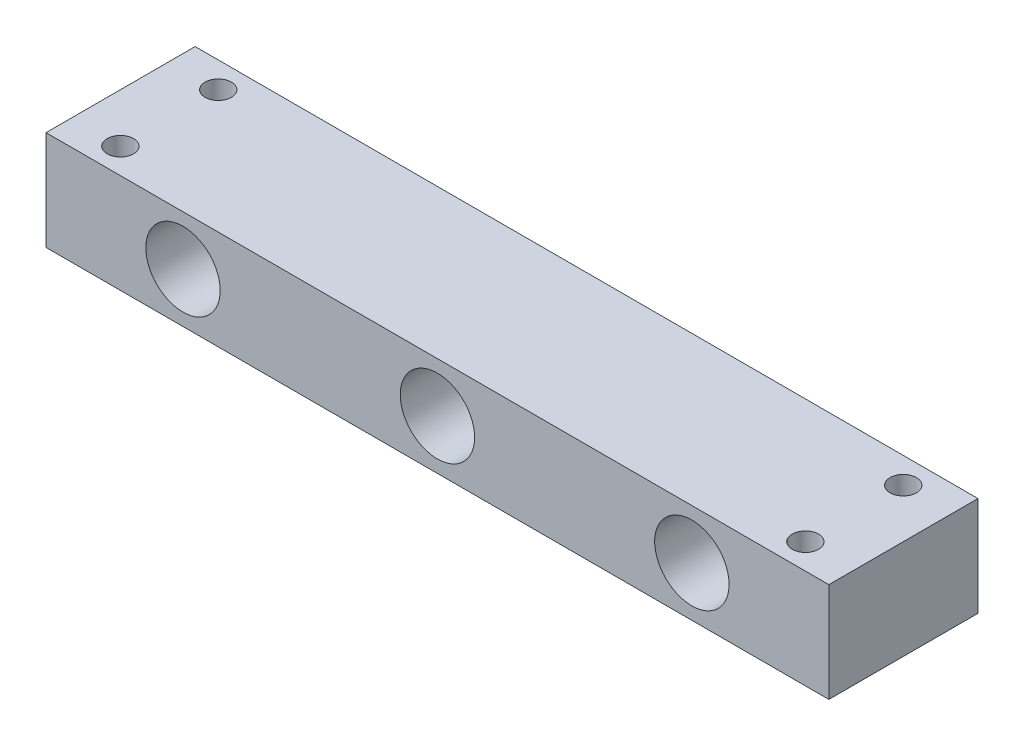
ISO-10303-21;
HEADER;
FILE_DESCRIPTION(('STEP AP214'),'2;1');
FILE_NAME('part.step','',(''),(''),'','','');
FILE_SCHEMA(('AUTOMOTIVE_DESIGN { 1 0 10303 214 1 1 1 1 }'));
ENDSEC;
DATA;
#1=APPLICATION_CONTEXT('core data for automotive mechanical design processes');
#2=APPLICATION_PROTOCOL_DEFINITION('international standard','automotive_design',2000,#1);
#3=PRODUCT_CONTEXT('',#1,'mechanical');
#4=PRODUCT('Part','Part','',(#3));
#5=PRODUCT_RELATED_PRODUCT_CATEGORY('part','',(#4));
#6=PRODUCT_DEFINITION_FORMATION('','',#4);
#7=PRODUCT_DEFINITION_CONTEXT('part definition',#1,'design');
#8=PRODUCT_DEFINITION('design','',#6,#7);
#9=PRODUCT_DEFINITION_SHAPE('','',#8);
#10=(LENGTH_UNIT() NAMED_UNIT(*) SI_UNIT(.MILLI.,.METRE.));
#11=(NAMED_UNIT(*) PLANE_ANGLE_UNIT() SI_UNIT($,.RADIAN.));
#12=(NAMED_UNIT(*) SI_UNIT($,.STERADIAN.) SOLID_ANGLE_UNIT());
#13=UNCERTAINTY_MEASURE_WITH_UNIT(LENGTH_MEASURE(1.E-05),#10,'distance_accuracy_value','');
#14=(GEOMETRIC_REPRESENTATION_CONTEXT(3) GLOBAL_UNCERTAINTY_ASSIGNED_CONTEXT((#13)) GLOBAL_UNIT_ASSIGNED_CONTEXT((#10,
#11,#12)) REPRESENTATION_CONTEXT('',''));
#15=CARTESIAN_POINT('',(0.,0.,0.));
#16=DIRECTION('',(0.,0.,1.));
#17=DIRECTION('',(1.,0.,0.));
#18=AXIS2_PLACEMENT_3D('',#15,#16,#17);
#19=CARTESIAN_POINT('',(0.,50.8,0.));
#20=DIRECTION('',(1.,0.,0.));
#21=DIRECTION('',(0.,0.,-1.));
#22=AXIS2_PLACEMENT_3D('',#19,#20,#21);
#23=PLANE('',#22);
#24=DIRECTION('',(0.,0.,1.));
#25=VECTOR('',#24,1.);
#26=CARTESIAN_POINT('',(0.,0.,0.));
#27=LINE('',#26,#25);
#28=CARTESIAN_POINT('',(0.,0.,-76.2));
#29=VERTEX_POINT('',#28);
#30=CARTESIAN_POINT('',(0.,0.,0.));
#31=VERTEX_POINT('',#30);
#32=EDGE_CURVE('E94',#29,#31,#27,.T.);
#33=ORIENTED_EDGE('',*,*,#32,.T.);
#34=DIRECTION('',(0.,-1.,0.));
#35=VECTOR('',#34,1.);
#36=CARTESIAN_POINT('',(0.,50.8,0.));
#37=LINE('',#36,#35);
#38=CARTESIAN_POINT('',(0.,50.8,0.));
#39=VERTEX_POINT('',#38);
#40=EDGE_CURVE('E11',#39,#31,#37,.T.);
#41=ORIENTED_EDGE('',*,*,#40,.F.);
#42=DIRECTION('',(0.,0.,1.));
#43=VECTOR('',#42,1.);
#44=CARTESIAN_POINT('',(0.,50.8,0.));
#45=LINE('',#44,#43);
#46=CARTESIAN_POINT('',(0.,50.8,-76.2));
#47=VERTEX_POINT('',#46);
#48=EDGE_CURVE('E82',#47,#39,#45,.T.);
#49=ORIENTED_EDGE('',*,*,#48,.F.);
#50=DIRECTION('',(0.,-1.,0.));
#51=VECTOR('',#50,1.);
#52=CARTESIAN_POINT('',(0.,50.8,-76.2));
#53=LINE('',#52,#51);
#54=EDGE_CURVE('E90',#47,#29,#53,.T.);
#55=ORIENTED_EDGE('',*,*,#54,.T.);
#56=EDGE_LOOP('',(#33,#41,#49,#55));
#57=FACE_BOUND('',#56,.T.);
#58=ADVANCED_FACE('F31',(#57),#23,.F.);
#59=CARTESIAN_POINT('',(0.,50.8,0.));
#60=DIRECTION('',(0.,0.,-1.));
#61=DIRECTION('',(-1.,0.,0.));
#62=AXIS2_PLACEMENT_3D('',#59,#60,#61);
#63=PLANE('',#62);
#64=CARTESIAN_POINT('',(330.,25.4,0.));
#65=DIRECTION('',(0.,0.,1.));
#66=DIRECTION('',(1.,0.,0.));
#67=AXIS2_PLACEMENT_3D('',#64,#65,#66);
#68=CIRCLE('',#67,19.);
#69=CARTESIAN_POINT('',(349.,25.4,0.));
#70=VERTEX_POINT('',#69);
#71=EDGE_CURVE('E144',#70,#70,#68,.T.);
#72=ORIENTED_EDGE('',*,*,#71,.F.);
#73=EDGE_LOOP('',(#72));
#74=FACE_BOUND('',#73,.T.);
#75=CARTESIAN_POINT('',(200.,25.4,0.));
#76=DIRECTION('',(0.,0.,1.));
#77=DIRECTION('',(1.,0.,0.));
#78=AXIS2_PLACEMENT_3D('',#75,#76,#77);
#79=CIRCLE('',#78,19.);
#80=CARTESIAN_POINT('',(219.,25.4,0.));
#81=VERTEX_POINT('',#80);
#82=EDGE_CURVE('E138',#81,#81,#79,.T.);
#83=ORIENTED_EDGE('',*,*,#82,.F.);
#84=EDGE_LOOP('',(#83));
#85=FACE_BOUND('',#84,.T.);
#86=CARTESIAN_POINT('',(70.,25.4,0.));
#87=DIRECTION('',(0.,0.,1.));
#88=DIRECTION('',(1.,0.,0.));
#89=AXIS2_PLACEMENT_3D('',#86,#87,#88);
#90=CIRCLE('',#89,19.);
#91=CARTESIAN_POINT('',(89.,25.4,0.));
#92=VERTEX_POINT('',#91);
#93=EDGE_CURVE('E132',#92,#92,#90,.T.);
#94=ORIENTED_EDGE('',*,*,#93,.F.);
#95=EDGE_LOOP('',(#94));
#96=FACE_BOUND('',#95,.T.);
#97=DIRECTION('',(1.,0.,0.));
#98=VECTOR('',#97,1.);
#99=CARTESIAN_POINT('',(0.,0.,0.));
#100=LINE('',#99,#98);
#101=CARTESIAN_POINT('',(400.,0.,0.));
#102=VERTEX_POINT('',#101);
#103=EDGE_CURVE('E86',#31,#102,#100,.T.);
#104=ORIENTED_EDGE('',*,*,#103,.T.);
#105=DIRECTION('',(0.,-1.,0.));
#106=VECTOR('',#105,1.);
#107=CARTESIAN_POINT('',(400.,50.8,0.));
#108=LINE('',#107,#106);
#109=CARTESIAN_POINT('',(400.,50.8,0.));
#110=VERTEX_POINT('',#109);
#111=EDGE_CURVE('E39',#110,#102,#108,.T.);
#112=ORIENTED_EDGE('',*,*,#111,.F.);
#113=DIRECTION('',(1.,0.,0.));
#114=VECTOR('',#113,1.);
#115=CARTESIAN_POINT('',(0.,50.8,0.));
#116=LINE('',#115,#114);
#117=EDGE_CURVE('E77',#39,#110,#116,.T.);
#118=ORIENTED_EDGE('',*,*,#117,.F.);
#119=ORIENTED_EDGE('',*,*,#40,.T.);
#120=EDGE_LOOP('',(#104,#112,#118,#119));
#121=FACE_BOUND('',#120,.T.);
#122=ADVANCED_FACE('F85',(#74,#85,#96,#121),#63,.F.);
#123=CARTESIAN_POINT('',(400.,50.8,0.));
#124=DIRECTION('',(-1.,0.,0.));
#125=DIRECTION('',(0.,0.,1.));
#126=AXIS2_PLACEMENT_3D('',#123,#124,#125);
#127=PLANE('',#126);
#128=DIRECTION('',(0.,0.,-1.));
#129=VECTOR('',#128,1.);
#130=CARTESIAN_POINT('',(400.,0.,0.));
#131=LINE('',#130,#129);
#132=CARTESIAN_POINT('',(400.,0.,-76.2));
#133=VERTEX_POINT('',#132);
#134=EDGE_CURVE('E64',#102,#133,#131,.T.);
#135=ORIENTED_EDGE('',*,*,#134,.T.);
#136=DIRECTION('',(0.,-1.,0.));
#137=VECTOR('',#136,1.);
#138=CARTESIAN_POINT('',(400.,50.8,-76.2));
#139=LINE('',#138,#137);
#140=CARTESIAN_POINT('',(400.,50.8,-76.2));
#141=VERTEX_POINT('',#140);
#142=EDGE_CURVE('E87',#141,#133,#139,.T.);
#143=ORIENTED_EDGE('',*,*,#142,.F.);
#144=DIRECTION('',(0.,0.,-1.));
#145=VECTOR('',#144,1.);
#146=CARTESIAN_POINT('',(400.,50.8,0.));
#147=LINE('',#146,#145);
#148=EDGE_CURVE('E80',#110,#141,#147,.T.);
#149=ORIENTED_EDGE('',*,*,#148,.F.);
#150=ORIENTED_EDGE('',*,*,#111,.T.);
#151=EDGE_LOOP('',(#135,#143,#149,#150));
#152=FACE_BOUND('',#151,.T.);
#153=ADVANCED_FACE('F88',(#152),#127,.F.);
#154=CARTESIAN_POINT('',(0.,50.8,-76.2));
#155=DIRECTION('',(0.,0.,1.));
#156=DIRECTION('',(1.,0.,0.));
#157=AXIS2_PLACEMENT_3D('',#154,#155,#156);
#158=PLANE('',#157);
#159=CARTESIAN_POINT('',(330.,25.4,-76.2));
#160=DIRECTION('',(0.,0.,1.));
#161=DIRECTION('',(1.,0.,0.));
#162=AXIS2_PLACEMENT_3D('',#159,#160,#161);
#163=CIRCLE('',#162,19.);
#164=CARTESIAN_POINT('',(349.,25.4,-76.2));
#165=VERTEX_POINT('',#164);
#166=EDGE_CURVE('E141',#165,#165,#163,.T.);
#167=ORIENTED_EDGE('',*,*,#166,.T.);
#168=EDGE_LOOP('',(#167));
#169=FACE_BOUND('',#168,.T.);
#170=CARTESIAN_POINT('',(200.,25.4,-76.2));
#171=DIRECTION('',(0.,0.,1.));
#172=DIRECTION('',(1.,0.,0.));
#173=AXIS2_PLACEMENT_3D('',#170,#171,#172);
#174=CIRCLE('',#173,19.);
#175=CARTESIAN_POINT('',(219.,25.4,-76.2));
#176=VERTEX_POINT('',#175);
#177=EDGE_CURVE('E135',#176,#176,#174,.T.);
#178=ORIENTED_EDGE('',*,*,#177,.T.);
#179=EDGE_LOOP('',(#178));
#180=FACE_BOUND('',#179,.T.);
#181=CARTESIAN_POINT('',(70.,25.4,-76.2));
#182=DIRECTION('',(0.,0.,1.));
#183=DIRECTION('',(1.,0.,0.));
#184=AXIS2_PLACEMENT_3D('',#181,#182,#183);
#185=CIRCLE('',#184,19.);
#186=CARTESIAN_POINT('',(89.,25.4,-76.2));
#187=VERTEX_POINT('',#186);
#188=EDGE_CURVE('E129',#187,#187,#185,.T.);
#189=ORIENTED_EDGE('',*,*,#188,.T.);
#190=EDGE_LOOP('',(#189));
#191=FACE_BOUND('',#190,.T.);
#192=DIRECTION('',(-1.,0.,0.));
#193=VECTOR('',#192,1.);
#194=CARTESIAN_POINT('',(0.,0.,-76.2));
#195=LINE('',#194,#193);
#196=EDGE_CURVE('E70',#133,#29,#195,.T.);
#197=ORIENTED_EDGE('',*,*,#196,.T.);
#198=ORIENTED_EDGE('',*,*,#54,.F.);
#199=DIRECTION('',(-1.,0.,0.));
#200=VECTOR('',#199,1.);
#201=CARTESIAN_POINT('',(0.,50.8,-76.2));
#202=LINE('',#201,#200);
#203=EDGE_CURVE('E47',#141,#47,#202,.T.);
#204=ORIENTED_EDGE('',*,*,#203,.F.);
#205=ORIENTED_EDGE('',*,*,#142,.T.);
#206=EDGE_LOOP('',(#197,#198,#204,#205));
#207=FACE_BOUND('',#206,.T.);
#208=ADVANCED_FACE('F102',(#169,#180,#191,#207),#158,.F.);
#209=CARTESIAN_POINT('',(0.,50.8,-76.2));
#210=DIRECTION('',(0.,-1.,0.));
#211=DIRECTION('',(0.,0.,-1.));
#212=AXIS2_PLACEMENT_3D('',#209,#210,#211);
#213=PLANE('',#212);
#214=CARTESIAN_POINT('',(25.,50.8,-63.));
#215=DIRECTION('',(0.,1.,0.));
#216=DIRECTION('',(0.,0.,1.));
#217=AXIS2_PLACEMENT_3D('',#214,#215,#216);
#218=CIRCLE('',#217,6.75);
#219=CARTESIAN_POINT('',(25.,50.8,-56.25));
#220=VERTEX_POINT('',#219);
#221=EDGE_CURVE('E123',#220,#220,#218,.T.);
#222=ORIENTED_EDGE('',*,*,#221,.F.);
#223=EDGE_LOOP('',(#222));
#224=FACE_BOUND('',#223,.T.);
#225=CARTESIAN_POINT('',(375.,50.8,-13.));
#226=DIRECTION('',(0.,1.,0.));
#227=DIRECTION('',(0.,0.,1.));
#228=AXIS2_PLACEMENT_3D('',#225,#226,#227);
#229=CIRCLE('',#228,6.74999999999997);
#230=CARTESIAN_POINT('',(375.,50.8,-6.25000000000002));
#231=VERTEX_POINT('',#230);
#232=EDGE_CURVE('E117',#231,#231,#229,.T.);
#233=ORIENTED_EDGE('',*,*,#232,.F.);
#234=EDGE_LOOP('',(#233));
#235=FACE_BOUND('',#234,.T.);
#236=CARTESIAN_POINT('',(25.,50.8,-13.));
#237=DIRECTION('',(0.,1.,0.));
#238=DIRECTION('',(0.,0.,1.));
#239=AXIS2_PLACEMENT_3D('',#236,#237,#238);
#240=CIRCLE('',#239,6.75);
#241=CARTESIAN_POINT('',(25.,50.8,-6.24999999999999));
#242=VERTEX_POINT('',#241);
#243=EDGE_CURVE('E111',#242,#242,#240,.T.);
#244=ORIENTED_EDGE('',*,*,#243,.F.);
#245=EDGE_LOOP('',(#244));
#246=FACE_BOUND('',#245,.T.);
#247=CARTESIAN_POINT('',(375.,50.8,-63.));
#248=DIRECTION('',(0.,1.,0.));
#249=DIRECTION('',(0.,0.,1.));
#250=AXIS2_PLACEMENT_3D('',#247,#248,#249);
#251=CIRCLE('',#250,6.74999999999997);
#252=CARTESIAN_POINT('',(375.,50.8,-56.25));
#253=VERTEX_POINT('',#252);
#254=EDGE_CURVE('E108',#253,#253,#251,.T.);
#255=ORIENTED_EDGE('',*,*,#254,.F.);
#256=EDGE_LOOP('',(#255));
#257=FACE_BOUND('',#256,.T.);
#258=ORIENTED_EDGE('',*,*,#48,.T.);
#259=ORIENTED_EDGE('',*,*,#117,.T.);
#260=ORIENTED_EDGE('',*,*,#148,.T.);
#261=ORIENTED_EDGE('',*,*,#203,.T.);
#262=EDGE_LOOP('',(#258,#259,#260,#261));
#263=FACE_BOUND('',#262,.T.);
#264=ADVANCED_FACE('F78',(#224,#235,#246,#257,#263),#213,.F.);
#265=CARTESIAN_POINT('',(0.,0.,-76.2));
#266=DIRECTION('',(0.,-1.,0.));
#267=DIRECTION('',(0.,0.,-1.));
#268=AXIS2_PLACEMENT_3D('',#265,#266,#267);
#269=PLANE('',#268);
#270=CARTESIAN_POINT('',(25.,0.,-63.));
#271=DIRECTION('',(0.,1.,0.));
#272=DIRECTION('',(0.,0.,1.));
#273=AXIS2_PLACEMENT_3D('',#270,#271,#272);
#274=CIRCLE('',#273,6.75);
#275=CARTESIAN_POINT('',(25.,0.,-56.25));
#276=VERTEX_POINT('',#275);
#277=EDGE_CURVE('E126',#276,#276,#274,.T.);
#278=ORIENTED_EDGE('',*,*,#277,.T.);
#279=EDGE_LOOP('',(#278));
#280=FACE_BOUND('',#279,.T.);
#281=CARTESIAN_POINT('',(375.,0.,-13.));
#282=DIRECTION('',(0.,1.,0.));
#283=DIRECTION('',(0.,0.,1.));
#284=AXIS2_PLACEMENT_3D('',#281,#282,#283);
#285=CIRCLE('',#284,6.74999999999997);
#286=CARTESIAN_POINT('',(375.,0.,-6.25000000000002));
#287=VERTEX_POINT('',#286);
#288=EDGE_CURVE('E120',#287,#287,#285,.T.);
#289=ORIENTED_EDGE('',*,*,#288,.T.);
#290=EDGE_LOOP('',(#289));
#291=FACE_BOUND('',#290,.T.);
#292=CARTESIAN_POINT('',(25.,0.,-13.));
#293=DIRECTION('',(0.,1.,0.));
#294=DIRECTION('',(0.,0.,1.));
#295=AXIS2_PLACEMENT_3D('',#292,#293,#294);
#296=CIRCLE('',#295,6.75);
#297=CARTESIAN_POINT('',(25.,0.,-6.24999999999999));
#298=VERTEX_POINT('',#297);
#299=EDGE_CURVE('E114',#298,#298,#296,.T.);
#300=ORIENTED_EDGE('',*,*,#299,.T.);
#301=EDGE_LOOP('',(#300));
#302=FACE_BOUND('',#301,.T.);
#303=CARTESIAN_POINT('',(375.,0.,-63.));
#304=DIRECTION('',(0.,1.,0.));
#305=DIRECTION('',(0.,0.,1.));
#306=AXIS2_PLACEMENT_3D('',#303,#304,#305);
#307=CIRCLE('',#306,6.74999999999997);
#308=CARTESIAN_POINT('',(375.,0.,-56.25));
#309=VERTEX_POINT('',#308);
#310=EDGE_CURVE('E97',#309,#309,#307,.T.);
#311=ORIENTED_EDGE('',*,*,#310,.T.);
#312=EDGE_LOOP('',(#311));
#313=FACE_BOUND('',#312,.T.);
#314=ORIENTED_EDGE('',*,*,#32,.F.);
#315=ORIENTED_EDGE('',*,*,#196,.F.);
#316=ORIENTED_EDGE('',*,*,#134,.F.);
#317=ORIENTED_EDGE('',*,*,#103,.F.);
#318=EDGE_LOOP('',(#314,#315,#316,#317));
#319=FACE_BOUND('',#318,.T.);
#320=ADVANCED_FACE('F105',(#280,#291,#302,#313,#319),#269,.T.);
#321=CARTESIAN_POINT('',(375.,0.,-63.));
#322=DIRECTION('',(0.,1.,0.));
#323=DIRECTION('',(0.,0.,1.));
#324=AXIS2_PLACEMENT_3D('',#321,#322,#323);
#325=CYLINDRICAL_SURFACE('',#324,6.74999999999997);
#326=ORIENTED_EDGE('',*,*,#310,.F.);
#327=EDGE_LOOP('',(#326));
#328=FACE_BOUND('',#327,.T.);
#329=ORIENTED_EDGE('',*,*,#254,.T.);
#330=EDGE_LOOP('',(#329));
#331=FACE_BOUND('',#330,.T.);
#332=ADVANCED_FACE('F213',(#328,#331),#325,.F.);
#333=CARTESIAN_POINT('',(25.,0.,-13.));
#334=DIRECTION('',(0.,1.,0.));
#335=DIRECTION('',(0.,0.,1.));
#336=AXIS2_PLACEMENT_3D('',#333,#334,#335);
#337=CYLINDRICAL_SURFACE('',#336,6.75);
#338=ORIENTED_EDGE('',*,*,#299,.F.);
#339=EDGE_LOOP('',(#338));
#340=FACE_BOUND('',#339,.T.);
#341=ORIENTED_EDGE('',*,*,#243,.T.);
#342=EDGE_LOOP('',(#341));
#343=FACE_BOUND('',#342,.T.);
#344=ADVANCED_FACE('F221',(#340,#343),#337,.F.);
#345=CARTESIAN_POINT('',(375.,0.,-13.));
#346=DIRECTION('',(0.,1.,0.));
#347=DIRECTION('',(0.,0.,1.));
#348=AXIS2_PLACEMENT_3D('',#345,#346,#347);
#349=CYLINDRICAL_SURFACE('',#348,6.74999999999997);
#350=ORIENTED_EDGE('',*,*,#288,.F.);
#351=EDGE_LOOP('',(#350));
#352=FACE_BOUND('',#351,.T.);
#353=ORIENTED_EDGE('',*,*,#232,.T.);
#354=EDGE_LOOP('',(#353));
#355=FACE_BOUND('',#354,.T.);
#356=ADVANCED_FACE('F176',(#352,#355),#349,.F.);
#357=CARTESIAN_POINT('',(25.,0.,-63.));
#358=DIRECTION('',(0.,1.,0.));
#359=DIRECTION('',(0.,0.,1.));
#360=AXIS2_PLACEMENT_3D('',#357,#358,#359);
#361=CYLINDRICAL_SURFACE('',#360,6.75);
#362=ORIENTED_EDGE('',*,*,#277,.F.);
#363=EDGE_LOOP('',(#362));
#364=FACE_BOUND('',#363,.T.);
#365=ORIENTED_EDGE('',*,*,#221,.T.);
#366=EDGE_LOOP('',(#365));
#367=FACE_BOUND('',#366,.T.);
#368=ADVANCED_FACE('F167',(#364,#367),#361,.F.);
#369=CARTESIAN_POINT('',(70.,25.4,-76.2));
#370=DIRECTION('',(0.,0.,1.));
#371=DIRECTION('',(1.,0.,0.));
#372=AXIS2_PLACEMENT_3D('',#369,#370,#371);
#373=CYLINDRICAL_SURFACE('',#372,19.);
#374=ORIENTED_EDGE('',*,*,#188,.F.);
#375=EDGE_LOOP('',(#374));
#376=FACE_BOUND('',#375,.T.);
#377=ORIENTED_EDGE('',*,*,#93,.T.);
#378=EDGE_LOOP('',(#377));
#379=FACE_BOUND('',#378,.T.);
#380=ADVANCED_FACE('F165',(#376,#379),#373,.F.);
#381=CARTESIAN_POINT('',(200.,25.4,-76.2));
#382=DIRECTION('',(0.,0.,1.));
#383=DIRECTION('',(1.,0.,0.));
#384=AXIS2_PLACEMENT_3D('',#381,#382,#383);
#385=CYLINDRICAL_SURFACE('',#384,19.);
#386=ORIENTED_EDGE('',*,*,#177,.F.);
#387=EDGE_LOOP('',(#386));
#388=FACE_BOUND('',#387,.T.);
#389=ORIENTED_EDGE('',*,*,#82,.T.);
#390=EDGE_LOOP('',(#389));
#391=FACE_BOUND('',#390,.T.);
#392=ADVANCED_FACE('F155',(#388,#391),#385,.F.);
#393=CARTESIAN_POINT('',(330.,25.4,-76.2));
#394=DIRECTION('',(0.,0.,1.));
#395=DIRECTION('',(1.,0.,0.));
#396=AXIS2_PLACEMENT_3D('',#393,#394,#395);
#397=CYLINDRICAL_SURFACE('',#396,19.);
#398=ORIENTED_EDGE('',*,*,#166,.F.);
#399=EDGE_LOOP('',(#398));
#400=FACE_BOUND('',#399,.T.);
#401=ORIENTED_EDGE('',*,*,#71,.T.);
#402=EDGE_LOOP('',(#401));
#403=FACE_BOUND('',#402,.T.);
#404=ADVANCED_FACE('F152',(#400,#403),#397,.F.);
#405=CLOSED_SHELL('',(#58,#122,#153,#208,#264,#320,#332,#344,#356,#368,#380,#392,#404));
#406=MANIFOLD_SOLID_BREP('B2',#405);
#407=ADVANCED_BREP_SHAPE_REPRESENTATION('',(#18,#406),#14);
#408=SHAPE_DEFINITION_REPRESENTATION(#9,#407);
ENDSEC;
END-ISO-10303-21;
